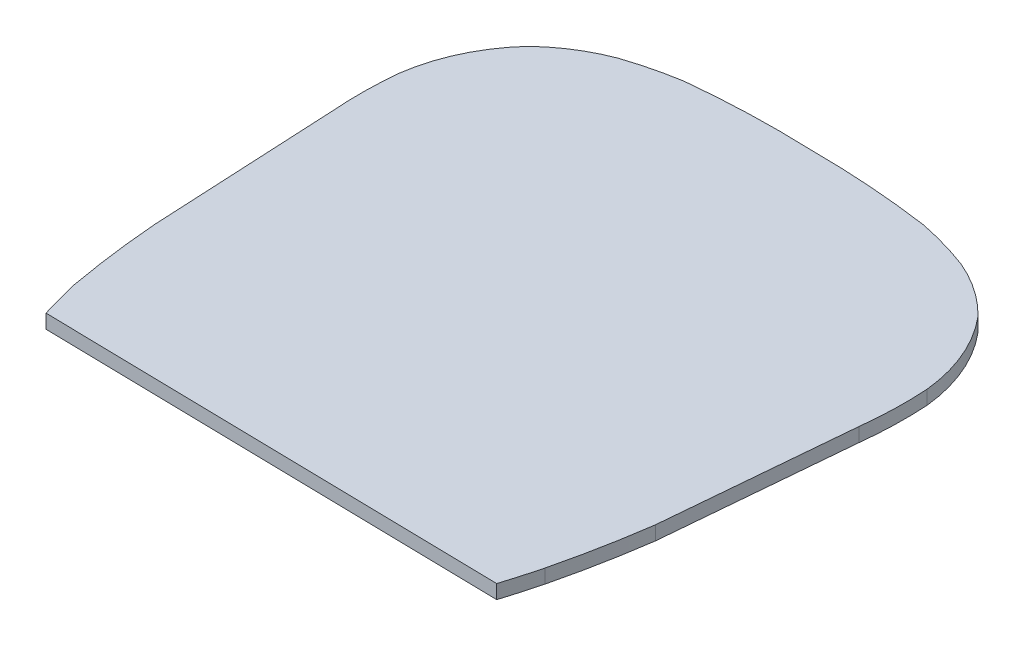
ISO-10303-21;
HEADER;
FILE_DESCRIPTION(('STEP AP214'),'2;1');
FILE_NAME('part.step','',(''),(''),'','','');
FILE_SCHEMA(('AUTOMOTIVE_DESIGN { 1 0 10303 214 1 1 1 1 }'));
ENDSEC;
DATA;
#1=APPLICATION_CONTEXT('core data for automotive mechanical design processes');
#2=APPLICATION_PROTOCOL_DEFINITION('international standard','automotive_design',2000,#1);
#3=PRODUCT_CONTEXT('',#1,'mechanical');
#4=PRODUCT('Part','Part','',(#3));
#5=PRODUCT_RELATED_PRODUCT_CATEGORY('part','',(#4));
#6=PRODUCT_DEFINITION_FORMATION('','',#4);
#7=PRODUCT_DEFINITION_CONTEXT('part definition',#1,'design');
#8=PRODUCT_DEFINITION('design','',#6,#7);
#9=PRODUCT_DEFINITION_SHAPE('','',#8);
#10=(LENGTH_UNIT() NAMED_UNIT(*) SI_UNIT(.MILLI.,.METRE.));
#11=(NAMED_UNIT(*) PLANE_ANGLE_UNIT() SI_UNIT($,.RADIAN.));
#12=(NAMED_UNIT(*) SI_UNIT($,.STERADIAN.) SOLID_ANGLE_UNIT());
#13=UNCERTAINTY_MEASURE_WITH_UNIT(LENGTH_MEASURE(1.E-05),#10,'distance_accuracy_value','');
#14=(GEOMETRIC_REPRESENTATION_CONTEXT(3) GLOBAL_UNCERTAINTY_ASSIGNED_CONTEXT((#13)) GLOBAL_UNIT_ASSIGNED_CONTEXT((#10,
#11,#12)) REPRESENTATION_CONTEXT('',''));
#15=CARTESIAN_POINT('',(0.,0.,0.));
#16=DIRECTION('',(0.,0.,1.));
#17=DIRECTION('',(1.,0.,0.));
#18=AXIS2_PLACEMENT_3D('',#15,#16,#17);
#19=CARTESIAN_POINT('',(-1.36046503595607,9.83260732929241,52.5016083672339));
#20=DIRECTION('',(0.,1.,0.));
#21=DIRECTION('',(1.,0.,0.));
#22=AXIS2_PLACEMENT_3D('',#19,#20,#21);
#23=PLANE('',#22);
#24=CARTESIAN_POINT('',(-4.37013016763331,9.83260732929197,27.5379677922569));
#25=DIRECTION('',(0.,-1.,0.));
#26=DIRECTION('',(-1.,0.,0.));
#27=AXIS2_PLACEMENT_3D('',#24,#25,#26);
#28=CIRCLE('',#27,5.8978740195184);
#29=CARTESIAN_POINT('',(-6.4526006970007,9.83260732929182,22.0199759071209));
#30=VERTEX_POINT('',#29);
#31=CARTESIAN_POINT('',(-8.44146750084398,9.83260732929177,23.2707520408196));
#32=VERTEX_POINT('',#31);
#33=EDGE_CURVE('E202',#30,#32,#28,.F.);
#34=ORIENTED_EDGE('',*,*,#33,.F.);
#35=CARTESIAN_POINT('',(-2.6398741660623,9.8326073292921,33.4324565511725));
#36=DIRECTION('',(0.,-1.,0.));
#37=DIRECTION('',(-1.,0.,0.));
#38=AXIS2_PLACEMENT_3D('',#35,#36,#37);
#39=CIRCLE('',#38,12.0325225140272);
#40=CARTESIAN_POINT('',(-4.55165338902239,9.83260732929187,21.5527807031861));
#41=VERTEX_POINT('',#40);
#42=EDGE_CURVE('E206',#41,#30,#39,.F.);
#43=ORIENTED_EDGE('',*,*,#42,.F.);
#44=CARTESIAN_POINT('',(-1.36046503595607,9.83260732929241,52.5016083672339));
#45=DIRECTION('',(0.,-1.,0.));
#46=DIRECTION('',(-1.,0.,0.));
#47=AXIS2_PLACEMENT_3D('',#44,#45,#46);
#48=CIRCLE('',#47,31.1129172030472);
#49=CARTESIAN_POINT('',(-0.169342384586067,9.83260732929201,21.411499912726));
#50=VERTEX_POINT('',#49);
#51=EDGE_CURVE('E210',#50,#41,#48,.F.);
#52=ORIENTED_EDGE('',*,*,#51,.F.);
#53=CARTESIAN_POINT('',(-0.182374456973019,9.83260732929245,52.5244144203988));
#54=DIRECTION('',(0.,-1.,0.));
#55=DIRECTION('',(-1.,0.,0.));
#56=AXIS2_PLACEMENT_3D('',#53,#54,#55);
#57=CIRCLE('',#56,31.1129172370042);
#58=CARTESIAN_POINT('',(4.20421740056315,9.83260732929216,21.722280876242));
#59=VERTEX_POINT('',#58);
#60=EDGE_CURVE('E141',#59,#50,#57,.F.);
#61=ORIENTED_EDGE('',*,*,#60,.F.);
#62=CARTESIAN_POINT('',(1.83409836317071,9.83260732929225,33.5190657687101));
#63=DIRECTION('',(0.,-1.,0.));
#64=DIRECTION('',(-1.,0.,0.));
#65=AXIS2_PLACEMENT_3D('',#62,#63,#64);
#66=CIRCLE('',#65,12.0325225140272);
#67=CARTESIAN_POINT('',(6.08565889926491,9.83260732929223,22.2626973019931));
#68=VERTEX_POINT('',#67);
#69=EDGE_CURVE('E20',#68,#59,#66,.F.);
#70=ORIENTED_EDGE('',*,*,#69,.F.);
#71=CARTESIAN_POINT('',(3.79118897956393,9.83260732929223,27.6959583612188));
#72=DIRECTION('',(0.,-1.,0.));
#73=DIRECTION('',(-1.,0.,0.));
#74=AXIS2_PLACEMENT_3D('',#71,#72,#73);
#75=CIRCLE('',#74,5.8978740195184);
#76=CARTESIAN_POINT('',(8.0246275477915,9.83260732929231,23.5895102805591));
#77=VERTEX_POINT('',#76);
#78=EDGE_CURVE('E139',#77,#68,#75,.F.);
#79=ORIENTED_EDGE('',*,*,#78,.F.);
#80=CARTESIAN_POINT('',(3.55501445798425,9.83260732929222,27.3587008181954));
#81=DIRECTION('',(0.,-1.,0.));
#82=DIRECTION('',(-1.,0.,0.));
#83=AXIS2_PLACEMENT_3D('',#80,#81,#82);
#84=CIRCLE('',#83,5.846728870196);
#85=CARTESIAN_POINT('',(9.37218086356147,9.83260732929239,26.7714926000928));
#86=VERTEX_POINT('',#85);
#87=EDGE_CURVE('E153',#86,#77,#84,.F.);
#88=ORIENTED_EDGE('',*,*,#87,.F.);
#89=CARTESIAN_POINT('',(-4.1887049235251,9.83260732929198,27.5941169099866));
#90=DIRECTION('',(0.,-1.,0.));
#91=DIRECTION('',(-1.,0.,0.));
#92=AXIS2_PLACEMENT_3D('',#89,#90,#91);
#93=CIRCLE('',#92,13.5858137071592);
#94=CARTESIAN_POINT('',(9.30805599838975,9.83260732929245,29.1471071553865));
#95=VERTEX_POINT('',#94);
#96=EDGE_CURVE('E171',#95,#86,#93,.F.);
#97=ORIENTED_EDGE('',*,*,#96,.F.);
#98=DIRECTION('',(0.0886995040357044,0.,-0.996058431008854));
#99=VECTOR('',#98,1.);
#100=CARTESIAN_POINT('',(9.30805599838976,9.83260732929249,29.1471071553863));
#101=LINE('',#100,#99);
#102=CARTESIAN_POINT('',(8.71091619186954,9.83260732929248,35.8527380970886));
#103=VERTEX_POINT('',#102);
#104=EDGE_CURVE('E224',#103,#95,#101,.T.);
#105=ORIENTED_EDGE('',*,*,#104,.F.);
#106=CARTESIAN_POINT('',(-24.6525623560492,9.83260732929136,31.1552688284916));
#107=DIRECTION('',(0.,-1.,0.));
#108=DIRECTION('',(-1.,0.,0.));
#109=AXIS2_PLACEMENT_3D('',#106,#107,#108);
#110=CIRCLE('',#109,33.6925498938096);
#111=CARTESIAN_POINT('',(8.07275678430066,9.83260732929254,39.1703424718899));
#112=VERTEX_POINT('',#111);
#113=EDGE_CURVE('E175',#112,#103,#110,.F.);
#114=ORIENTED_EDGE('',*,*,#113,.F.);
#115=CARTESIAN_POINT('',(-19.4802591858728,9.83260732929155,32.0720202096182));
#116=DIRECTION('',(0.,-1.,0.));
#117=DIRECTION('',(-1.,0.,0.));
#118=AXIS2_PLACEMENT_3D('',#115,#116,#117);
#119=CIRCLE('',#118,28.4526776945808);
#120=CARTESIAN_POINT('',(7.68914938739529,9.83260732929209,40.5205766407797));
#121=VERTEX_POINT('',#120);
#122=EDGE_CURVE('E180',#121,#112,#119,.F.);
#123=ORIENTED_EDGE('',*,*,#122,.F.);
#124=DIRECTION('',(0.999812677663925,0.,0.0193548335692306));
#125=VECTOR('',#124,1.);
#126=CARTESIAN_POINT('',(7.68914938739525,9.832607329292,40.5205766407797));
#127=LINE('',#126,#125);
#128=CARTESIAN_POINT('',(-8.79631360580716,9.83260732929245,40.2014434674631));
#129=VERTEX_POINT('',#128);
#130=EDGE_CURVE('E228',#129,#121,#127,.T.);
#131=ORIENTED_EDGE('',*,*,#130,.F.);
#132=CARTESIAN_POINT('',(18.4703009162602,9.83260732929277,32.072076917929));
#133=DIRECTION('',(0.,-1.,0.));
#134=DIRECTION('',(-1.,0.,0.));
#135=AXIS2_PLACEMENT_3D('',#132,#133,#134);
#136=CIRCLE('',#135,28.4526776945808);
#137=CARTESIAN_POINT('',(-9.16667491968078,9.83260732929202,38.83613151819));
#138=VERTEX_POINT('',#137);
#139=EDGE_CURVE('E184',#138,#129,#136,.F.);
#140=ORIENTED_EDGE('',*,*,#139,.F.);
#141=CARTESIAN_POINT('',(23.9837047982159,9.83260732929294,32.816144565869));
#142=DIRECTION('',(0.,-1.,0.));
#143=DIRECTION('',(-1.,0.,0.));
#144=AXIS2_PLACEMENT_3D('',#141,#142,#143);
#145=CIRCLE('',#144,33.6925498938096);
#146=CARTESIAN_POINT('',(-9.6017513815914,9.83260732929185,35.5003672729286));
#147=VERTEX_POINT('',#146);
#148=EDGE_CURVE('E189',#147,#138,#145,.F.);
#149=ORIENTED_EDGE('',*,*,#148,.F.);
#150=DIRECTION('',(0.0500831809567752,0.,0.998745050042928));
#151=VECTOR('',#150,1.);
#152=CARTESIAN_POINT('',(-9.60175138159139,9.83260732929181,35.5003672729288));
#153=LINE('',#152,#151);
#154=CARTESIAN_POINT('',(-9.9390268081998,9.8326073292918,28.7745132758158));
#155=VERTEX_POINT('',#154);
#156=EDGE_CURVE('E231',#155,#147,#153,.T.);
#157=ORIENTED_EDGE('',*,*,#156,.F.);
#158=CARTESIAN_POINT('',(3.60772655621584,9.83260732929222,27.7450438156915));
#159=DIRECTION('',(0.,-1.,0.));
#160=DIRECTION('',(-1.,0.,0.));
#161=AXIS2_PLACEMENT_3D('',#158,#159,#160);
#162=CIRCLE('',#161,13.5858137071592);
#163=CARTESIAN_POINT('',(-9.91116160713017,9.83260732929177,26.3981967892708));
#164=VERTEX_POINT('',#163);
#165=EDGE_CURVE('E193',#164,#155,#162,.F.);
#166=ORIENTED_EDGE('',*,*,#165,.F.);
#167=CARTESIAN_POINT('',(-4.12107991081805,9.83260732929196,27.2101034536201));
#168=DIRECTION('',(0.,-1.,0.));
#169=DIRECTION('',(-1.,0.,0.));
#170=AXIS2_PLACEMENT_3D('',#167,#168,#169);
#171=CIRCLE('',#170,5.846728870196);
#172=EDGE_CURVE('E198',#32,#164,#171,.F.);
#173=ORIENTED_EDGE('',*,*,#172,.F.);
#174=EDGE_LOOP('',(#34,#43,#52,#61,#70,#79,#88,#97,#105,#114,#123,#131,#140,#149,#157,#166,#173));
#175=FACE_BOUND('',#174,.T.);
#176=ADVANCED_FACE('F17',(#175),#23,.F.);
#177=CARTESIAN_POINT('',(1.83409836317065,11.3657600923941,33.51906576871));
#178=DIRECTION('',(0.,-1.,0.));
#179=DIRECTION('',(-1.,0.,0.));
#180=AXIS2_PLACEMENT_3D('',#177,#178,#179);
#181=CYLINDRICAL_SURFACE('',#180,12.0325225140272);
#182=DIRECTION('',(0.,-1.,0.));
#183=VECTOR('',#182,1.);
#184=CARTESIAN_POINT('',(6.08565889926486,11.3657600923941,22.2626973019931));
#185=LINE('',#184,#183);
#186=CARTESIAN_POINT('',(6.0856588992649,10.3336073292922,22.2626973019931));
#187=VERTEX_POINT('',#186);
#188=EDGE_CURVE('E147',#68,#187,#185,.F.);
#189=ORIENTED_EDGE('',*,*,#188,.F.);
#190=ORIENTED_EDGE('',*,*,#69,.T.);
#191=DIRECTION('',(0.,-1.,0.));
#192=VECTOR('',#191,1.);
#193=CARTESIAN_POINT('',(4.20421740056311,11.365760092394,21.722280876242));
#194=LINE('',#193,#192);
#195=CARTESIAN_POINT('',(4.20421740056312,10.3336073292921,21.722280876242));
#196=VERTEX_POINT('',#195);
#197=EDGE_CURVE('E145',#196,#59,#194,.T.);
#198=ORIENTED_EDGE('',*,*,#197,.F.);
#199=CARTESIAN_POINT('',(1.83409836317069,10.3336073292922,33.51906576871));
#200=DIRECTION('',(0.,-1.,0.));
#201=DIRECTION('',(-1.,0.,0.));
#202=AXIS2_PLACEMENT_3D('',#199,#200,#201);
#203=CIRCLE('',#202,12.0325225140272);
#204=EDGE_CURVE('E150',#187,#196,#203,.F.);
#205=ORIENTED_EDGE('',*,*,#204,.F.);
#206=EDGE_LOOP('',(#189,#190,#198,#205));
#207=FACE_BOUND('',#206,.T.);
#208=ADVANCED_FACE('F148',(#207),#181,.T.);
#209=CARTESIAN_POINT('',(-0.182374456973068,11.3657600923943,52.5244144203988));
#210=DIRECTION('',(0.,-1.,0.));
#211=DIRECTION('',(-1.,0.,0.));
#212=AXIS2_PLACEMENT_3D('',#209,#210,#211);
#213=CYLINDRICAL_SURFACE('',#212,31.1129172370042);
#214=ORIENTED_EDGE('',*,*,#197,.T.);
#215=ORIENTED_EDGE('',*,*,#60,.T.);
#216=DIRECTION('',(0.,-1.,0.));
#217=VECTOR('',#216,1.);
#218=CARTESIAN_POINT('',(-0.169342384586067,11.3657600923939,21.4114999127259));
#219=LINE('',#218,#217);
#220=CARTESIAN_POINT('',(-0.169342384586083,10.333607329292,21.411499912726));
#221=VERTEX_POINT('',#220);
#222=EDGE_CURVE('E212',#221,#50,#219,.T.);
#223=ORIENTED_EDGE('',*,*,#222,.F.);
#224=CARTESIAN_POINT('',(-0.182374456973034,10.3336073292924,52.5244144203988));
#225=DIRECTION('',(0.,-1.,0.));
#226=DIRECTION('',(-1.,0.,0.));
#227=AXIS2_PLACEMENT_3D('',#224,#225,#226);
#228=CIRCLE('',#227,31.1129172370042);
#229=EDGE_CURVE('E162',#196,#221,#228,.F.);
#230=ORIENTED_EDGE('',*,*,#229,.F.);
#231=EDGE_LOOP('',(#214,#215,#223,#230));
#232=FACE_BOUND('',#231,.T.);
#233=ADVANCED_FACE('F281',(#232),#213,.T.);
#234=CARTESIAN_POINT('',(-1.36046503595612,11.3657600923943,52.5016083672338));
#235=DIRECTION('',(0.,-1.,0.));
#236=DIRECTION('',(-1.,0.,0.));
#237=AXIS2_PLACEMENT_3D('',#234,#235,#236);
#238=CYLINDRICAL_SURFACE('',#237,31.1129172030472);
#239=ORIENTED_EDGE('',*,*,#222,.T.);
#240=ORIENTED_EDGE('',*,*,#51,.T.);
#241=DIRECTION('',(0.,-1.,0.));
#242=VECTOR('',#241,1.);
#243=CARTESIAN_POINT('',(-4.55165338902245,11.3657600923937,21.5527807031861));
#244=LINE('',#243,#242);
#245=CARTESIAN_POINT('',(-4.55165338902245,10.3336073292919,21.5527807031861));
#246=VERTEX_POINT('',#245);
#247=EDGE_CURVE('E209',#246,#41,#244,.T.);
#248=ORIENTED_EDGE('',*,*,#247,.F.);
#249=CARTESIAN_POINT('',(-1.36046503595609,10.3336073292924,52.5016083672338));
#250=DIRECTION('',(0.,-1.,0.));
#251=DIRECTION('',(-1.,0.,0.));
#252=AXIS2_PLACEMENT_3D('',#249,#250,#251);
#253=CIRCLE('',#252,31.1129172030472);
#254=EDGE_CURVE('E273',#221,#246,#253,.F.);
#255=ORIENTED_EDGE('',*,*,#254,.F.);
#256=EDGE_LOOP('',(#239,#240,#248,#255));
#257=FACE_BOUND('',#256,.T.);
#258=ADVANCED_FACE('F283',(#257),#238,.T.);
#259=CARTESIAN_POINT('',(-2.63987416606234,11.365760092394,33.4324565511725));
#260=DIRECTION('',(0.,-1.,0.));
#261=DIRECTION('',(-1.,0.,0.));
#262=AXIS2_PLACEMENT_3D('',#259,#260,#261);
#263=CYLINDRICAL_SURFACE('',#262,12.0325225140272);
#264=ORIENTED_EDGE('',*,*,#247,.T.);
#265=ORIENTED_EDGE('',*,*,#42,.T.);
#266=DIRECTION('',(0.,-1.,0.));
#267=VECTOR('',#266,1.);
#268=CARTESIAN_POINT('',(-6.45260069700076,11.3657600923937,22.0199759071209));
#269=LINE('',#268,#267);
#270=CARTESIAN_POINT('',(-6.4526006970007,10.3336073292918,22.0199759071209));
#271=VERTEX_POINT('',#270);
#272=EDGE_CURVE('E205',#271,#30,#269,.T.);
#273=ORIENTED_EDGE('',*,*,#272,.F.);
#274=CARTESIAN_POINT('',(-2.63987416606231,10.3336073292921,33.4324565511725));
#275=DIRECTION('',(0.,-1.,0.));
#276=DIRECTION('',(-1.,0.,0.));
#277=AXIS2_PLACEMENT_3D('',#274,#275,#276);
#278=CIRCLE('',#277,12.0325225140272);
#279=EDGE_CURVE('E269',#246,#271,#278,.F.);
#280=ORIENTED_EDGE('',*,*,#279,.F.);
#281=EDGE_LOOP('',(#264,#265,#273,#280));
#282=FACE_BOUND('',#281,.T.);
#283=ADVANCED_FACE('F289',(#282),#263,.T.);
#284=CARTESIAN_POINT('',(-4.37013016763336,11.3657600923938,27.5379677922569));
#285=DIRECTION('',(0.,-1.,0.));
#286=DIRECTION('',(-1.,0.,0.));
#287=AXIS2_PLACEMENT_3D('',#284,#285,#286);
#288=CYLINDRICAL_SURFACE('',#287,5.8978740195184);
#289=ORIENTED_EDGE('',*,*,#272,.T.);
#290=ORIENTED_EDGE('',*,*,#33,.T.);
#291=DIRECTION('',(0.,-1.,0.));
#292=VECTOR('',#291,1.);
#293=CARTESIAN_POINT('',(-8.44146750084402,11.3657600923936,23.2707520408195));
#294=LINE('',#293,#292);
#295=CARTESIAN_POINT('',(-8.44146750084399,10.3336073292918,23.2707520408195));
#296=VERTEX_POINT('',#295);
#297=EDGE_CURVE('E201',#296,#32,#294,.T.);
#298=ORIENTED_EDGE('',*,*,#297,.F.);
#299=CARTESIAN_POINT('',(-4.37013016763333,10.333607329292,27.5379677922569));
#300=DIRECTION('',(0.,-1.,0.));
#301=DIRECTION('',(-1.,0.,0.));
#302=AXIS2_PLACEMENT_3D('',#299,#300,#301);
#303=CIRCLE('',#302,5.8978740195184);
#304=EDGE_CURVE('E265',#271,#296,#303,.F.);
#305=ORIENTED_EDGE('',*,*,#304,.F.);
#306=EDGE_LOOP('',(#289,#290,#298,#305));
#307=FACE_BOUND('',#306,.T.);
#308=ADVANCED_FACE('F294',(#307),#288,.T.);
#309=CARTESIAN_POINT('',(-4.1210799108181,11.3657600923938,27.2101034536201));
#310=DIRECTION('',(0.,-1.,0.));
#311=DIRECTION('',(-1.,0.,0.));
#312=AXIS2_PLACEMENT_3D('',#309,#310,#311);
#313=CYLINDRICAL_SURFACE('',#312,5.846728870196);
#314=ORIENTED_EDGE('',*,*,#297,.T.);
#315=ORIENTED_EDGE('',*,*,#172,.T.);
#316=DIRECTION('',(0.,-1.,0.));
#317=VECTOR('',#316,1.);
#318=CARTESIAN_POINT('',(-9.91116160713022,11.3657600923936,26.3981967892708));
#319=LINE('',#318,#317);
#320=CARTESIAN_POINT('',(-9.91116160713019,10.3336073292918,26.3981967892708));
#321=VERTEX_POINT('',#320);
#322=EDGE_CURVE('E197',#321,#164,#319,.T.);
#323=ORIENTED_EDGE('',*,*,#322,.F.);
#324=CARTESIAN_POINT('',(-4.12107991081807,10.333607329292,27.2101034536201));
#325=DIRECTION('',(0.,-1.,0.));
#326=DIRECTION('',(-1.,0.,0.));
#327=AXIS2_PLACEMENT_3D('',#324,#325,#326);
#328=CIRCLE('',#327,5.846728870196);
#329=EDGE_CURVE('E261',#296,#321,#328,.F.);
#330=ORIENTED_EDGE('',*,*,#329,.F.);
#331=EDGE_LOOP('',(#314,#315,#323,#330));
#332=FACE_BOUND('',#331,.T.);
#333=ADVANCED_FACE('F300',(#332),#313,.T.);
#334=CARTESIAN_POINT('',(3.60772655621579,11.3657600923941,27.7450438156915));
#335=DIRECTION('',(0.,-1.,0.));
#336=DIRECTION('',(-1.,0.,0.));
#337=AXIS2_PLACEMENT_3D('',#334,#335,#336);
#338=CYLINDRICAL_SURFACE('',#337,13.5858137071592);
#339=ORIENTED_EDGE('',*,*,#322,.T.);
#340=ORIENTED_EDGE('',*,*,#165,.T.);
#341=DIRECTION('',(0.,1.,0.));
#342=VECTOR('',#341,1.);
#343=CARTESIAN_POINT('',(-9.93902680819985,11.3657600923938,28.7745132758157));
#344=LINE('',#343,#342);
#345=CARTESIAN_POINT('',(-9.93902680819981,10.3336073292918,28.7745132758158));
#346=VERTEX_POINT('',#345);
#347=EDGE_CURVE('E196',#346,#155,#344,.F.);
#348=ORIENTED_EDGE('',*,*,#347,.F.);
#349=CARTESIAN_POINT('',(3.60772655621582,10.3336073292922,27.7450438156915));
#350=DIRECTION('',(0.,-1.,0.));
#351=DIRECTION('',(-1.,0.,0.));
#352=AXIS2_PLACEMENT_3D('',#349,#350,#351);
#353=CIRCLE('',#352,13.5858137071592);
#354=EDGE_CURVE('E257',#321,#346,#353,.F.);
#355=ORIENTED_EDGE('',*,*,#354,.F.);
#356=EDGE_LOOP('',(#339,#340,#348,#355));
#357=FACE_BOUND('',#356,.T.);
#358=ADVANCED_FACE('F307',(#357),#338,.T.);
#359=CARTESIAN_POINT('',(-9.60175138159144,11.3657600923938,35.5003672729288));
#360=DIRECTION('',(-0.998745050042928,0.,0.0500831809567752));
#361=DIRECTION('',(0.0500831809567752,0.,0.998745050042928));
#362=AXIS2_PLACEMENT_3D('',#359,#360,#361);
#363=PLANE('',#362);
#364=ORIENTED_EDGE('',*,*,#347,.T.);
#365=ORIENTED_EDGE('',*,*,#156,.T.);
#366=DIRECTION('',(0.,-1.,0.));
#367=VECTOR('',#366,1.);
#368=CARTESIAN_POINT('',(-9.60175138159144,11.3657600923938,35.5003672729287));
#369=LINE('',#368,#367);
#370=CARTESIAN_POINT('',(-9.6017513815914,10.3336073292919,35.5003672729288));
#371=VERTEX_POINT('',#370);
#372=EDGE_CURVE('E192',#371,#147,#369,.T.);
#373=ORIENTED_EDGE('',*,*,#372,.F.);
#374=DIRECTION('',(0.0500831809567757,0.,0.998745050042928));
#375=VECTOR('',#374,1.);
#376=CARTESIAN_POINT('',(-9.93902680819981,10.3336073292918,28.7745132758157));
#377=LINE('',#376,#375);
#378=EDGE_CURVE('E256',#346,#371,#377,.T.);
#379=ORIENTED_EDGE('',*,*,#378,.F.);
#380=EDGE_LOOP('',(#364,#365,#373,#379));
#381=FACE_BOUND('',#380,.T.);
#382=ADVANCED_FACE('F346',(#381),#363,.T.);
#383=CARTESIAN_POINT('',(23.9837047982159,11.3657600923948,32.8161445658689));
#384=DIRECTION('',(0.,-1.,0.));
#385=DIRECTION('',(-1.,0.,0.));
#386=AXIS2_PLACEMENT_3D('',#383,#384,#385);
#387=CYLINDRICAL_SURFACE('',#386,33.6925498938096);
#388=ORIENTED_EDGE('',*,*,#372,.T.);
#389=ORIENTED_EDGE('',*,*,#148,.T.);
#390=DIRECTION('',(0.,-1.,0.));
#391=VECTOR('',#390,1.);
#392=CARTESIAN_POINT('',(-9.16667491968082,11.3657600923938,38.83613151819));
#393=LINE('',#392,#391);
#394=CARTESIAN_POINT('',(-9.1666749196808,10.3336073292919,38.83613151819));
#395=VERTEX_POINT('',#394);
#396=EDGE_CURVE('E188',#395,#138,#393,.T.);
#397=ORIENTED_EDGE('',*,*,#396,.F.);
#398=CARTESIAN_POINT('',(23.9837047982159,10.3336073292929,32.816144565869));
#399=DIRECTION('',(0.,-1.,0.));
#400=DIRECTION('',(-1.,0.,0.));
#401=AXIS2_PLACEMENT_3D('',#398,#399,#400);
#402=CIRCLE('',#401,33.6925498938096);
#403=EDGE_CURVE('E253',#371,#395,#402,.F.);
#404=ORIENTED_EDGE('',*,*,#403,.F.);
#405=EDGE_LOOP('',(#388,#389,#397,#404));
#406=FACE_BOUND('',#405,.T.);
#407=ADVANCED_FACE('F352',(#406),#387,.T.);
#408=CARTESIAN_POINT('',(18.4703009162601,11.3657600923946,32.072076917929));
#409=DIRECTION('',(0.,-1.,0.));
#410=DIRECTION('',(-1.,0.,0.));
#411=AXIS2_PLACEMENT_3D('',#408,#409,#410);
#412=CYLINDRICAL_SURFACE('',#411,28.4526776945808);
#413=ORIENTED_EDGE('',*,*,#396,.T.);
#414=ORIENTED_EDGE('',*,*,#139,.T.);
#415=DIRECTION('',(0.,1.,0.));
#416=VECTOR('',#415,1.);
#417=CARTESIAN_POINT('',(-8.79631360580717,11.3657600923944,40.2014434674631));
#418=LINE('',#417,#416);
#419=CARTESIAN_POINT('',(-8.79631360580716,10.333607329292,40.2014434674631));
#420=VERTEX_POINT('',#419);
#421=EDGE_CURVE('E187',#420,#129,#418,.F.);
#422=ORIENTED_EDGE('',*,*,#421,.F.);
#423=CARTESIAN_POINT('',(18.4703009162602,10.3336073292927,32.072076917929));
#424=DIRECTION('',(0.,-1.,0.));
#425=DIRECTION('',(-1.,0.,0.));
#426=AXIS2_PLACEMENT_3D('',#423,#424,#425);
#427=CIRCLE('',#426,28.4526776945808);
#428=EDGE_CURVE('E249',#395,#420,#427,.F.);
#429=ORIENTED_EDGE('',*,*,#428,.F.);
#430=EDGE_LOOP('',(#413,#414,#422,#429));
#431=FACE_BOUND('',#430,.T.);
#432=ADVANCED_FACE('F355',(#431),#412,.T.);
#433=CARTESIAN_POINT('',(7.68914938739525,11.3657600923944,40.5205766407797));
#434=DIRECTION('',(-0.0193548335692306,0.,0.999812677663925));
#435=DIRECTION('',(0.999812677663925,0.,0.0193548335692306));
#436=AXIS2_PLACEMENT_3D('',#433,#434,#435);
#437=PLANE('',#436);
#438=ORIENTED_EDGE('',*,*,#421,.T.);
#439=ORIENTED_EDGE('',*,*,#130,.T.);
#440=DIRECTION('',(0.,-1.,0.));
#441=VECTOR('',#440,1.);
#442=CARTESIAN_POINT('',(7.68914938739524,11.3657600923944,40.5205766407797));
#443=LINE('',#442,#441);
#444=CARTESIAN_POINT('',(7.68914938739527,10.3336073292925,40.5205766407797));
#445=VERTEX_POINT('',#444);
#446=EDGE_CURVE('E183',#445,#121,#443,.T.);
#447=ORIENTED_EDGE('',*,*,#446,.F.);
#448=DIRECTION('',(0.999812677663925,0.,0.0193548335692305));
#449=VECTOR('',#448,1.);
#450=CARTESIAN_POINT('',(-8.79631360580717,10.333607329292,40.2014434674631));
#451=LINE('',#450,#449);
#452=EDGE_CURVE('E248',#420,#445,#451,.T.);
#453=ORIENTED_EDGE('',*,*,#452,.F.);
#454=EDGE_LOOP('',(#438,#439,#447,#453));
#455=FACE_BOUND('',#454,.T.);
#456=ADVANCED_FACE('F361',(#455),#437,.T.);
#457=CARTESIAN_POINT('',(-19.4802591858729,11.3657600923934,32.0720202096181));
#458=DIRECTION('',(0.,-1.,0.));
#459=DIRECTION('',(-1.,0.,0.));
#460=AXIS2_PLACEMENT_3D('',#457,#458,#459);
#461=CYLINDRICAL_SURFACE('',#460,28.4526776945808);
#462=ORIENTED_EDGE('',*,*,#446,.T.);
#463=ORIENTED_EDGE('',*,*,#122,.T.);
#464=DIRECTION('',(0.,-1.,0.));
#465=VECTOR('',#464,1.);
#466=CARTESIAN_POINT('',(8.07275678430063,11.3657600923944,39.1703424718898));
#467=LINE('',#466,#465);
#468=CARTESIAN_POINT('',(8.07275678430065,10.3336073292925,39.1703424718899));
#469=VERTEX_POINT('',#468);
#470=EDGE_CURVE('E179',#469,#112,#467,.T.);
#471=ORIENTED_EDGE('',*,*,#470,.F.);
#472=CARTESIAN_POINT('',(-19.4802591858728,10.3336073292915,32.0720202096181));
#473=DIRECTION('',(0.,-1.,0.));
#474=DIRECTION('',(-1.,0.,0.));
#475=AXIS2_PLACEMENT_3D('',#472,#473,#474);
#476=CIRCLE('',#475,28.4526776945808);
#477=EDGE_CURVE('E245',#445,#469,#476,.F.);
#478=ORIENTED_EDGE('',*,*,#477,.F.);
#479=EDGE_LOOP('',(#462,#463,#471,#478));
#480=FACE_BOUND('',#479,.T.);
#481=ADVANCED_FACE('F364',(#480),#461,.T.);
#482=CARTESIAN_POINT('',(-24.6525623560493,11.3657600923932,31.1552688284915));
#483=DIRECTION('',(0.,-1.,0.));
#484=DIRECTION('',(-1.,0.,0.));
#485=AXIS2_PLACEMENT_3D('',#482,#483,#484);
#486=CYLINDRICAL_SURFACE('',#485,33.6925498938096);
#487=ORIENTED_EDGE('',*,*,#470,.T.);
#488=ORIENTED_EDGE('',*,*,#113,.T.);
#489=DIRECTION('',(0.,1.,0.));
#490=VECTOR('',#489,1.);
#491=CARTESIAN_POINT('',(8.71091619186949,11.3657600923943,35.8527380970886));
#492=LINE('',#491,#490);
#493=CARTESIAN_POINT('',(8.71091619186953,10.3336073292925,35.8527380970884));
#494=VERTEX_POINT('',#493);
#495=EDGE_CURVE('E178',#494,#103,#492,.F.);
#496=ORIENTED_EDGE('',*,*,#495,.F.);
#497=CARTESIAN_POINT('',(-24.6525623560492,10.3336073292914,31.1552688284916));
#498=DIRECTION('',(0.,-1.,0.));
#499=DIRECTION('',(-1.,0.,0.));
#500=AXIS2_PLACEMENT_3D('',#497,#498,#499);
#501=CIRCLE('',#500,33.6925498938096);
#502=EDGE_CURVE('E241',#469,#494,#501,.F.);
#503=ORIENTED_EDGE('',*,*,#502,.F.);
#504=EDGE_LOOP('',(#487,#488,#496,#503));
#505=FACE_BOUND('',#504,.T.);
#506=ADVANCED_FACE('F368',(#505),#486,.T.);
#507=CARTESIAN_POINT('',(9.30805599838971,11.3657600923943,29.1471071553863));
#508=DIRECTION('',(0.996058431008854,0.,0.0886995040357044));
#509=DIRECTION('',(0.0886995040357044,0.,-0.996058431008854));
#510=AXIS2_PLACEMENT_3D('',#507,#508,#509);
#511=PLANE('',#510);
#512=ORIENTED_EDGE('',*,*,#495,.T.);
#513=ORIENTED_EDGE('',*,*,#104,.T.);
#514=DIRECTION('',(0.,-1.,0.));
#515=VECTOR('',#514,1.);
#516=CARTESIAN_POINT('',(9.3080559983897,11.3657600923943,29.1471071553864));
#517=LINE('',#516,#515);
#518=CARTESIAN_POINT('',(9.30805599838974,10.3336073292924,29.1471071553863));
#519=VERTEX_POINT('',#518);
#520=EDGE_CURVE('E174',#519,#95,#517,.T.);
#521=ORIENTED_EDGE('',*,*,#520,.F.);
#522=DIRECTION('',(0.0886995040357043,0.,-0.996058431008854));
#523=VECTOR('',#522,1.);
#524=CARTESIAN_POINT('',(8.71091619186953,10.3336073292925,35.8527380970886));
#525=LINE('',#524,#523);
#526=EDGE_CURVE('E240',#494,#519,#525,.T.);
#527=ORIENTED_EDGE('',*,*,#526,.F.);
#528=EDGE_LOOP('',(#512,#513,#521,#527));
#529=FACE_BOUND('',#528,.T.);
#530=ADVANCED_FACE('F375',(#529),#511,.T.);
#531=CARTESIAN_POINT('',(-4.18870492352516,11.3657600923938,27.5941169099866));
#532=DIRECTION('',(0.,-1.,0.));
#533=DIRECTION('',(-1.,0.,0.));
#534=AXIS2_PLACEMENT_3D('',#531,#532,#533);
#535=CYLINDRICAL_SURFACE('',#534,13.5858137071592);
#536=ORIENTED_EDGE('',*,*,#96,.T.);
#537=DIRECTION('',(0.,-1.,0.));
#538=VECTOR('',#537,1.);
#539=CARTESIAN_POINT('',(9.37218086356142,11.3657600923943,26.7714926000928));
#540=LINE('',#539,#538);
#541=CARTESIAN_POINT('',(9.37218086356146,10.3336073292924,26.7714926000928));
#542=VERTEX_POINT('',#541);
#543=EDGE_CURVE('E170',#542,#86,#540,.T.);
#544=ORIENTED_EDGE('',*,*,#543,.F.);
#545=CARTESIAN_POINT('',(-4.18870492352512,10.333607329292,27.5941169099866));
#546=DIRECTION('',(0.,-1.,0.));
#547=DIRECTION('',(-1.,0.,0.));
#548=AXIS2_PLACEMENT_3D('',#545,#546,#547);
#549=CIRCLE('',#548,13.5858137071592);
#550=EDGE_CURVE('E237',#519,#542,#549,.F.);
#551=ORIENTED_EDGE('',*,*,#550,.F.);
#552=ORIENTED_EDGE('',*,*,#520,.T.);
#553=EDGE_LOOP('',(#536,#544,#551,#552));
#554=FACE_BOUND('',#553,.T.);
#555=ADVANCED_FACE('F378',(#554),#535,.T.);
#556=CARTESIAN_POINT('',(3.5550144579842,11.3657600923941,27.3587008181954));
#557=DIRECTION('',(0.,-1.,0.));
#558=DIRECTION('',(-1.,0.,0.));
#559=AXIS2_PLACEMENT_3D('',#556,#557,#558);
#560=CYLINDRICAL_SURFACE('',#559,5.846728870196);
#561=ORIENTED_EDGE('',*,*,#543,.T.);
#562=ORIENTED_EDGE('',*,*,#87,.T.);
#563=DIRECTION('',(0.,-1.,0.));
#564=VECTOR('',#563,1.);
#565=CARTESIAN_POINT('',(8.02462754779146,11.3657600923942,23.5895102805591));
#566=LINE('',#565,#564);
#567=CARTESIAN_POINT('',(8.02462754779149,10.3336073292923,23.5895102805591));
#568=VERTEX_POINT('',#567);
#569=EDGE_CURVE('E36',#568,#77,#566,.T.);
#570=ORIENTED_EDGE('',*,*,#569,.F.);
#571=CARTESIAN_POINT('',(3.55501445798423,10.3336073292922,27.3587008181954));
#572=DIRECTION('',(0.,-1.,0.));
#573=DIRECTION('',(-1.,0.,0.));
#574=AXIS2_PLACEMENT_3D('',#571,#572,#573);
#575=CIRCLE('',#574,5.846728870196);
#576=EDGE_CURVE('E27',#542,#568,#575,.F.);
#577=ORIENTED_EDGE('',*,*,#576,.F.);
#578=EDGE_LOOP('',(#561,#562,#570,#577));
#579=FACE_BOUND('',#578,.T.);
#580=ADVANCED_FACE('F379',(#579),#560,.T.);
#581=CARTESIAN_POINT('',(3.79118897956388,11.3657600923941,27.6959583612188));
#582=DIRECTION('',(0.,-1.,0.));
#583=DIRECTION('',(-1.,0.,0.));
#584=AXIS2_PLACEMENT_3D('',#581,#582,#583);
#585=CYLINDRICAL_SURFACE('',#584,5.8978740195184);
#586=ORIENTED_EDGE('',*,*,#569,.T.);
#587=ORIENTED_EDGE('',*,*,#78,.T.);
#588=ORIENTED_EDGE('',*,*,#188,.T.);
#589=CARTESIAN_POINT('',(3.79118897956392,10.3336073292922,27.6959583612188));
#590=DIRECTION('',(0.,-1.,0.));
#591=DIRECTION('',(-1.,0.,0.));
#592=AXIS2_PLACEMENT_3D('',#589,#590,#591);
#593=CIRCLE('',#592,5.8978740195184);
#594=EDGE_CURVE('E11',#568,#187,#593,.F.);
#595=ORIENTED_EDGE('',*,*,#594,.F.);
#596=EDGE_LOOP('',(#586,#587,#588,#595));
#597=FACE_BOUND('',#596,.T.);
#598=ADVANCED_FACE('F155',(#597),#585,.T.);
#599=CARTESIAN_POINT('',(-4.37013016763333,10.333607329292,27.5379677922569));
#600=DIRECTION('',(0.,1.,0.));
#601=DIRECTION('',(1.,0.,0.));
#602=AXIS2_PLACEMENT_3D('',#599,#600,#601);
#603=PLANE('',#602);
#604=ORIENTED_EDGE('',*,*,#576,.T.);
#605=ORIENTED_EDGE('',*,*,#594,.T.);
#606=ORIENTED_EDGE('',*,*,#204,.T.);
#607=ORIENTED_EDGE('',*,*,#229,.T.);
#608=ORIENTED_EDGE('',*,*,#254,.T.);
#609=ORIENTED_EDGE('',*,*,#279,.T.);
#610=ORIENTED_EDGE('',*,*,#304,.T.);
#611=ORIENTED_EDGE('',*,*,#329,.T.);
#612=ORIENTED_EDGE('',*,*,#354,.T.);
#613=ORIENTED_EDGE('',*,*,#378,.T.);
#614=ORIENTED_EDGE('',*,*,#403,.T.);
#615=ORIENTED_EDGE('',*,*,#428,.T.);
#616=ORIENTED_EDGE('',*,*,#452,.T.);
#617=ORIENTED_EDGE('',*,*,#477,.T.);
#618=ORIENTED_EDGE('',*,*,#502,.T.);
#619=ORIENTED_EDGE('',*,*,#526,.T.);
#620=ORIENTED_EDGE('',*,*,#550,.T.);
#621=EDGE_LOOP('',(#604,#605,#606,#607,#608,#609,#610,#611,#612,#613,#614,#615,#616,#617,#618,
#619,#620));
#622=FACE_BOUND('',#621,.T.);
#623=ADVANCED_FACE('F279',(#622),#603,.T.);
#624=CLOSED_SHELL('',(#176,#208,#233,#258,#283,#308,#333,#358,#382,#407,#432,#456,#481,#506,
#530,#555,#580,#598,#623));
#625=MANIFOLD_SOLID_BREP('B1',#624);
#626=ADVANCED_BREP_SHAPE_REPRESENTATION('',(#18,#625),#14);
#627=SHAPE_DEFINITION_REPRESENTATION(#9,#626);
ENDSEC;
END-ISO-10303-21;
